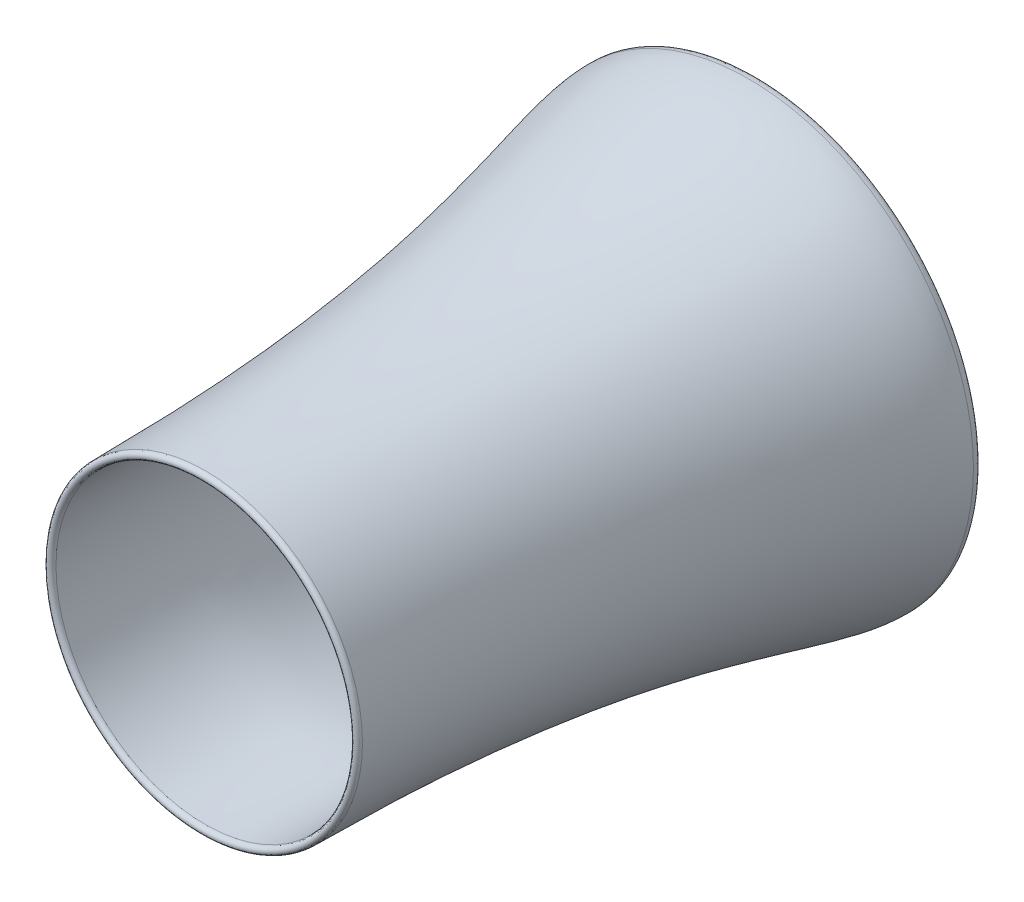
ISO-10303-21;
HEADER;
FILE_DESCRIPTION(('STEP AP214'),'2;1');
FILE_NAME('part.step','',(''),(''),'','','');
FILE_SCHEMA(('AUTOMOTIVE_DESIGN { 1 0 10303 214 1 1 1 1 }'));
ENDSEC;
DATA;
#1=APPLICATION_CONTEXT('core data for automotive mechanical design processes');
#2=APPLICATION_PROTOCOL_DEFINITION('international standard','automotive_design',2000,#1);
#3=PRODUCT_CONTEXT('',#1,'mechanical');
#4=PRODUCT('Part','Part','',(#3));
#5=PRODUCT_RELATED_PRODUCT_CATEGORY('part','',(#4));
#6=PRODUCT_DEFINITION_FORMATION('','',#4);
#7=PRODUCT_DEFINITION_CONTEXT('part definition',#1,'design');
#8=PRODUCT_DEFINITION('design','',#6,#7);
#9=PRODUCT_DEFINITION_SHAPE('','',#8);
#10=(LENGTH_UNIT() NAMED_UNIT(*) SI_UNIT(.MILLI.,.METRE.));
#11=(NAMED_UNIT(*) PLANE_ANGLE_UNIT() SI_UNIT($,.RADIAN.));
#12=(NAMED_UNIT(*) SI_UNIT($,.STERADIAN.) SOLID_ANGLE_UNIT());
#13=UNCERTAINTY_MEASURE_WITH_UNIT(LENGTH_MEASURE(1.E-05),#10,'distance_accuracy_value','');
#14=(GEOMETRIC_REPRESENTATION_CONTEXT(3) GLOBAL_UNCERTAINTY_ASSIGNED_CONTEXT((#13)) GLOBAL_UNIT_ASSIGNED_CONTEXT((#10,
#11,#12)) REPRESENTATION_CONTEXT('',''));
#15=CARTESIAN_POINT('',(0.,0.,0.));
#16=DIRECTION('',(0.,0.,1.));
#17=DIRECTION('',(1.,0.,0.));
#18=AXIS2_PLACEMENT_3D('',#15,#16,#17);
#19=CARTESIAN_POINT('',(-110.643738413778,0.,1084.89282660609));
#20=CARTESIAN_POINT('',(-110.643738413781,0.,795.78420596623));
#21=CARTESIAN_POINT('',(-92.4228112382727,0.,818.968893630078));
#22=CARTESIAN_POINT('',(-173.314715972783,0.,383.138357007349));
#23=CARTESIAN_POINT('',(-207.74770414259,0.,105.812239726664));
#24=CARTESIAN_POINT('',(-259.495458194181,0.,7.17355419661932));
#25=CARTESIAN_POINT('',(-259.495458194181,0.,-45.4621983253943));
#26=B_SPLINE_CURVE_WITH_KNOTS('',3,(#19,#20,#21,#22,#23,#24,#25),.UNSPECIFIED.,.F.,.F.,(4,1,1,1,
4),(0.,0.515022649097204,0.793493092504956,0.841990827595236,1.),.UNSPECIFIED.);
#27=CARTESIAN_POINT('',(200.,0.,-115.791199571968));
#28=DIRECTION('',(0.,0.,-1.));
#29=AXIS1_PLACEMENT('',#27,#28);
#30=SURFACE_OF_REVOLUTION('',#26,#29);
#31=CARTESIAN_POINT('',(200.,0.,-45.4621983253943));
#32=DIRECTION('',(0.,0.,-1.));
#33=DIRECTION('',(-1.,0.,0.));
#34=AXIS2_PLACEMENT_3D('',#31,#32,#33);
#35=CIRCLE('',#34,459.495458194181);
#36=CARTESIAN_POINT('',(-259.495458194181,0.,-45.4621983253943));
#37=VERTEX_POINT('',#36);
#38=EDGE_CURVE('E42',#37,#37,#35,.T.);
#39=ORIENTED_EDGE('',*,*,#38,.T.);
#40=EDGE_LOOP('',(#39));
#41=FACE_BOUND('',#40,.T.);
#42=CARTESIAN_POINT('',(200.,0.,1084.89282660609));
#43=DIRECTION('',(0.,0.,-1.));
#44=DIRECTION('',(-1.,0.,0.));
#45=AXIS2_PLACEMENT_3D('',#42,#43,#44);
#46=CIRCLE('',#45,310.643738413778);
#47=CARTESIAN_POINT('',(-110.643738413778,0.,1084.89282660609));
#48=VERTEX_POINT('',#47);
#49=EDGE_CURVE('E10',#48,#48,#46,.T.);
#50=ORIENTED_EDGE('',*,*,#49,.F.);
#51=EDGE_LOOP('',(#50));
#52=FACE_BOUND('',#51,.T.);
#53=ADVANCED_FACE('F31',(#41,#52),#30,.F.);
#54=CARTESIAN_POINT('',(-267.23685774948,0.,-45.4621983253943));
#55=CARTESIAN_POINT('',(-267.23685774948,0.,79.921754050898));
#56=CARTESIAN_POINT('',(-126.781859005936,0.,354.583706220873));
#57=CARTESIAN_POINT('',(-126.781859005936,0.,1084.89282660609));
#58=B_SPLINE_CURVE_WITH_KNOTS('',3,(#54,#55,#56,#57),.UNSPECIFIED.,.F.,.F.,(4,4),(0.,1.),.UNSPECIFIED.);
#59=CARTESIAN_POINT('',(200.,0.,-115.791199571968));
#60=DIRECTION('',(0.,0.,-1.));
#61=AXIS1_PLACEMENT('',#59,#60);
#62=SURFACE_OF_REVOLUTION('',#58,#61);
#63=CARTESIAN_POINT('',(200.,0.,1084.89282660609));
#64=DIRECTION('',(0.,0.,-1.));
#65=DIRECTION('',(-1.,0.,0.));
#66=AXIS2_PLACEMENT_3D('',#63,#64,#65);
#67=CIRCLE('',#66,326.781859005936);
#68=CARTESIAN_POINT('',(-126.781859005936,0.,1084.89282660609));
#69=VERTEX_POINT('',#68);
#70=EDGE_CURVE('E46',#69,#69,#67,.T.);
#71=ORIENTED_EDGE('',*,*,#70,.T.);
#72=EDGE_LOOP('',(#71));
#73=FACE_BOUND('',#72,.T.);
#74=CARTESIAN_POINT('',(200.,0.,-45.4621983253943));
#75=DIRECTION('',(0.,0.,-1.));
#76=DIRECTION('',(-1.,0.,0.));
#77=AXIS2_PLACEMENT_3D('',#74,#75,#76);
#78=CIRCLE('',#77,467.23685774948);
#79=CARTESIAN_POINT('',(-267.23685774948,0.,-45.4621983253943));
#80=VERTEX_POINT('',#79);
#81=EDGE_CURVE('E38',#80,#80,#78,.T.);
#82=ORIENTED_EDGE('',*,*,#81,.F.);
#83=EDGE_LOOP('',(#82));
#84=FACE_BOUND('',#83,.T.);
#85=ADVANCED_FACE('F58',(#73,#84),#62,.F.);
#86=CARTESIAN_POINT('',(-259.495458194181,0.,-45.4621983253943));
#87=CARTESIAN_POINT('',(-259.495458194181,0.,-62.3955316587277));
#88=CARTESIAN_POINT('',(-267.23685774948,0.,-62.3955316587277));
#89=CARTESIAN_POINT('',(-267.23685774948,0.,-45.4621983253943));
#90=B_SPLINE_CURVE_WITH_KNOTS('',3,(#86,#87,#88,#89),.UNSPECIFIED.,.F.,.F.,(4,4),(0.,1.),.UNSPECIFIED.);
#91=CARTESIAN_POINT('',(200.,0.,-115.791199571968));
#92=DIRECTION('',(0.,0.,-1.));
#93=AXIS1_PLACEMENT('',#91,#92);
#94=SURFACE_OF_REVOLUTION('',#90,#93);
#95=ORIENTED_EDGE('',*,*,#81,.T.);
#96=EDGE_LOOP('',(#95));
#97=FACE_BOUND('',#96,.T.);
#98=ORIENTED_EDGE('',*,*,#38,.F.);
#99=EDGE_LOOP('',(#98));
#100=FACE_BOUND('',#99,.T.);
#101=ADVANCED_FACE('F61',(#97,#100),#94,.F.);
#102=CARTESIAN_POINT('',(-126.781859005936,0.,1084.89282660609));
#103=CARTESIAN_POINT('',(-126.781859005936,0.,1097.59282660609));
#104=CARTESIAN_POINT('',(-110.643738413778,0.,1097.59282660609));
#105=CARTESIAN_POINT('',(-110.643738413778,0.,1084.89282660609));
#106=B_SPLINE_CURVE_WITH_KNOTS('',3,(#102,#103,#104,#105),.UNSPECIFIED.,.F.,.F.,(4,4),(0.,1.),.UNSPECIFIED.);
#107=CARTESIAN_POINT('',(200.,0.,-115.791199571968));
#108=DIRECTION('',(0.,0.,-1.));
#109=AXIS1_PLACEMENT('',#107,#108);
#110=SURFACE_OF_REVOLUTION('',#106,#109);
#111=ORIENTED_EDGE('',*,*,#49,.T.);
#112=EDGE_LOOP('',(#111));
#113=FACE_BOUND('',#112,.T.);
#114=ORIENTED_EDGE('',*,*,#70,.F.);
#115=EDGE_LOOP('',(#114));
#116=FACE_BOUND('',#115,.T.);
#117=ADVANCED_FACE('F66',(#113,#116),#110,.F.);
#118=CLOSED_SHELL('',(#53,#85,#101,#117));
#119=MANIFOLD_SOLID_BREP('B2',#118);
#120=ADVANCED_BREP_SHAPE_REPRESENTATION('',(#18,#119),#14);
#121=SHAPE_DEFINITION_REPRESENTATION(#9,#120);
ENDSEC;
END-ISO-10303-21;
